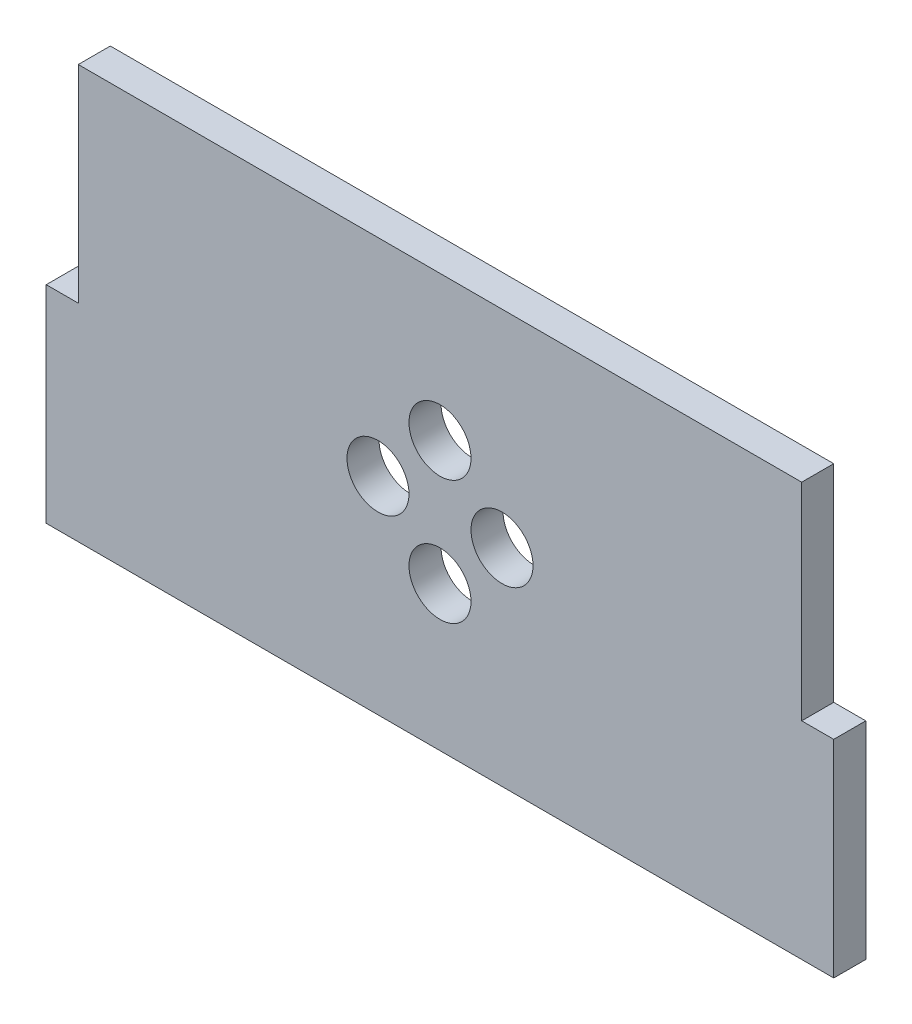
ISO-10303-21;
HEADER;
FILE_DESCRIPTION(('STEP AP214'),'2;1');
FILE_NAME('part.step','',(''),(''),'','','');
FILE_SCHEMA(('AUTOMOTIVE_DESIGN { 1 0 10303 214 1 1 1 1 }'));
ENDSEC;
DATA;
#1=APPLICATION_CONTEXT('core data for automotive mechanical design processes');
#2=APPLICATION_PROTOCOL_DEFINITION('international standard','automotive_design',2000,#1);
#3=PRODUCT_CONTEXT('',#1,'mechanical');
#4=PRODUCT('Part','Part','',(#3));
#5=PRODUCT_RELATED_PRODUCT_CATEGORY('part','',(#4));
#6=PRODUCT_DEFINITION_FORMATION('','',#4);
#7=PRODUCT_DEFINITION_CONTEXT('part definition',#1,'design');
#8=PRODUCT_DEFINITION('design','',#6,#7);
#9=PRODUCT_DEFINITION_SHAPE('','',#8);
#10=(LENGTH_UNIT() NAMED_UNIT(*) SI_UNIT(.MILLI.,.METRE.));
#11=(NAMED_UNIT(*) PLANE_ANGLE_UNIT() SI_UNIT($,.RADIAN.));
#12=(NAMED_UNIT(*) SI_UNIT($,.STERADIAN.) SOLID_ANGLE_UNIT());
#13=UNCERTAINTY_MEASURE_WITH_UNIT(LENGTH_MEASURE(1.E-05),#10,'distance_accuracy_value','');
#14=(GEOMETRIC_REPRESENTATION_CONTEXT(3) GLOBAL_UNCERTAINTY_ASSIGNED_CONTEXT((#13)) GLOBAL_UNIT_ASSIGNED_CONTEXT((#10,
#11,#12)) REPRESENTATION_CONTEXT('',''));
#15=CARTESIAN_POINT('',(0.,0.,0.));
#16=DIRECTION('',(0.,0.,1.));
#17=DIRECTION('',(1.,0.,0.));
#18=AXIS2_PLACEMENT_3D('',#15,#16,#17);
#19=CARTESIAN_POINT('',(35.,-20.,3.1));
#20=DIRECTION('',(-1.,0.,0.));
#21=DIRECTION('',(0.,0.,1.));
#22=AXIS2_PLACEMENT_3D('',#19,#20,#21);
#23=PLANE('',#22);
#24=DIRECTION('',(0.,0.,1.));
#25=VECTOR('',#24,1.);
#26=CARTESIAN_POINT('',(35.,0.,0.));
#27=LINE('',#26,#25);
#28=CARTESIAN_POINT('',(35.,0.,0.));
#29=VERTEX_POINT('',#28);
#30=CARTESIAN_POINT('',(35.,0.,3.1));
#31=VERTEX_POINT('',#30);
#32=EDGE_CURVE('E56',#29,#31,#27,.T.);
#33=ORIENTED_EDGE('',*,*,#32,.F.);
#34=DIRECTION('',(0.,1.,0.));
#35=VECTOR('',#34,1.);
#36=CARTESIAN_POINT('',(35.,-20.,0.));
#37=LINE('',#36,#35);
#38=CARTESIAN_POINT('',(35.,20.,0.));
#39=VERTEX_POINT('',#38);
#40=EDGE_CURVE('E175',#29,#39,#37,.T.);
#41=ORIENTED_EDGE('',*,*,#40,.T.);
#42=DIRECTION('',(0.,0.,-1.));
#43=VECTOR('',#42,1.);
#44=CARTESIAN_POINT('',(35.,20.,3.1));
#45=LINE('',#44,#43);
#46=CARTESIAN_POINT('',(35.,20.,3.1));
#47=VERTEX_POINT('',#46);
#48=EDGE_CURVE('E11',#47,#39,#45,.T.);
#49=ORIENTED_EDGE('',*,*,#48,.F.);
#50=DIRECTION('',(0.,1.,0.));
#51=VECTOR('',#50,1.);
#52=CARTESIAN_POINT('',(35.,-20.,3.1));
#53=LINE('',#52,#51);
#54=EDGE_CURVE('E151',#31,#47,#53,.T.);
#55=ORIENTED_EDGE('',*,*,#54,.F.);
#56=EDGE_LOOP('',(#33,#41,#49,#55));
#57=FACE_BOUND('',#56,.T.);
#58=ADVANCED_FACE('F32',(#57),#23,.F.);
#59=CARTESIAN_POINT('',(0.,0.,3.1));
#60=DIRECTION('',(0.,0.,-1.));
#61=DIRECTION('',(-1.,0.,0.));
#62=AXIS2_PLACEMENT_3D('',#59,#60,#61);
#63=PLANE('',#62);
#64=CARTESIAN_POINT('',(6.,0.,3.1));
#65=DIRECTION('',(0.,0.,1.));
#66=DIRECTION('',(1.,0.,0.));
#67=AXIS2_PLACEMENT_3D('',#64,#65,#66);
#68=CIRCLE('',#67,3.);
#69=CARTESIAN_POINT('',(9.,0.,3.1));
#70=VERTEX_POINT('',#69);
#71=EDGE_CURVE('E193',#70,#70,#68,.T.);
#72=ORIENTED_EDGE('',*,*,#71,.F.);
#73=EDGE_LOOP('',(#72));
#74=FACE_BOUND('',#73,.T.);
#75=CARTESIAN_POINT('',(-6.,0.,3.1));
#76=DIRECTION('',(0.,0.,1.));
#77=DIRECTION('',(1.,0.,0.));
#78=AXIS2_PLACEMENT_3D('',#75,#76,#77);
#79=CIRCLE('',#78,3.);
#80=CARTESIAN_POINT('',(-3.,0.,3.1));
#81=VERTEX_POINT('',#80);
#82=EDGE_CURVE('E176',#81,#81,#79,.T.);
#83=ORIENTED_EDGE('',*,*,#82,.F.);
#84=EDGE_LOOP('',(#83));
#85=FACE_BOUND('',#84,.T.);
#86=DIRECTION('',(1.,0.,0.));
#87=VECTOR('',#86,1.);
#88=CARTESIAN_POINT('',(-35.,-20.,3.1));
#89=LINE('',#88,#87);
#90=CARTESIAN_POINT('',(-38.1,-20.,3.1));
#91=VERTEX_POINT('',#90);
#92=CARTESIAN_POINT('',(38.1,-20.,3.1));
#93=VERTEX_POINT('',#92);
#94=EDGE_CURVE('E174',#91,#93,#89,.T.);
#95=ORIENTED_EDGE('',*,*,#94,.T.);
#96=DIRECTION('',(0.,1.,0.));
#97=VECTOR('',#96,1.);
#98=CARTESIAN_POINT('',(38.1,0.,3.1));
#99=LINE('',#98,#97);
#100=CARTESIAN_POINT('',(38.1,0.,3.1));
#101=VERTEX_POINT('',#100);
#102=EDGE_CURVE('E135',#93,#101,#99,.T.);
#103=ORIENTED_EDGE('',*,*,#102,.T.);
#104=DIRECTION('',(-1.,0.,0.));
#105=VECTOR('',#104,1.);
#106=CARTESIAN_POINT('',(35.,0.,3.1));
#107=LINE('',#106,#105);
#108=EDGE_CURVE('E125',#101,#31,#107,.T.);
#109=ORIENTED_EDGE('',*,*,#108,.T.);
#110=ORIENTED_EDGE('',*,*,#54,.T.);
#111=DIRECTION('',(-1.,0.,0.));
#112=VECTOR('',#111,1.);
#113=CARTESIAN_POINT('',(-35.,20.,3.1));
#114=LINE('',#113,#112);
#115=CARTESIAN_POINT('',(-35.,20.,3.1));
#116=VERTEX_POINT('',#115);
#117=EDGE_CURVE('E181',#47,#116,#114,.T.);
#118=ORIENTED_EDGE('',*,*,#117,.T.);
#119=DIRECTION('',(0.,-1.,0.));
#120=VECTOR('',#119,1.);
#121=CARTESIAN_POINT('',(-35.,-20.,3.1));
#122=LINE('',#121,#120);
#123=CARTESIAN_POINT('',(-35.,0.,3.1));
#124=VERTEX_POINT('',#123);
#125=EDGE_CURVE('E166',#116,#124,#122,.T.);
#126=ORIENTED_EDGE('',*,*,#125,.T.);
#127=DIRECTION('',(-1.,0.,0.));
#128=VECTOR('',#127,1.);
#129=CARTESIAN_POINT('',(-35.,0.,3.1));
#130=LINE('',#129,#128);
#131=CARTESIAN_POINT('',(-38.1,0.,3.1));
#132=VERTEX_POINT('',#131);
#133=EDGE_CURVE('E48',#124,#132,#130,.T.);
#134=ORIENTED_EDGE('',*,*,#133,.T.);
#135=DIRECTION('',(0.,-1.,0.));
#136=VECTOR('',#135,1.);
#137=CARTESIAN_POINT('',(-38.1,0.,3.1));
#138=LINE('',#137,#136);
#139=EDGE_CURVE('E104',#132,#91,#138,.T.);
#140=ORIENTED_EDGE('',*,*,#139,.T.);
#141=EDGE_LOOP('',(#95,#103,#109,#110,#118,#126,#134,#140));
#142=FACE_BOUND('',#141,.T.);
#143=CARTESIAN_POINT('',(0.,5.99999999999998,3.1));
#144=DIRECTION('',(0.,0.,1.));
#145=DIRECTION('',(1.,0.,0.));
#146=AXIS2_PLACEMENT_3D('',#143,#144,#145);
#147=CIRCLE('',#146,3.);
#148=CARTESIAN_POINT('',(3.00000000000002,5.99999999999998,3.1));
#149=VERTEX_POINT('',#148);
#150=EDGE_CURVE('E187',#149,#149,#147,.T.);
#151=ORIENTED_EDGE('',*,*,#150,.F.);
#152=EDGE_LOOP('',(#151));
#153=FACE_BOUND('',#152,.T.);
#154=CARTESIAN_POINT('',(0.,-6.00000000000002,3.1));
#155=DIRECTION('',(0.,0.,1.));
#156=DIRECTION('',(1.,0.,0.));
#157=AXIS2_PLACEMENT_3D('',#154,#155,#156);
#158=CIRCLE('',#157,3.);
#159=CARTESIAN_POINT('',(2.99999999999998,-6.00000000000002,3.1));
#160=VERTEX_POINT('',#159);
#161=EDGE_CURVE('E146',#160,#160,#158,.T.);
#162=ORIENTED_EDGE('',*,*,#161,.F.);
#163=EDGE_LOOP('',(#162));
#164=FACE_BOUND('',#163,.T.);
#165=ADVANCED_FACE('F209',(#74,#85,#142,#153,#164),#63,.F.);
#166=CARTESIAN_POINT('',(0.,0.,0.));
#167=DIRECTION('',(0.,0.,-1.));
#168=DIRECTION('',(-1.,0.,0.));
#169=AXIS2_PLACEMENT_3D('',#166,#167,#168);
#170=PLANE('',#169);
#171=CARTESIAN_POINT('',(6.,0.,0.));
#172=DIRECTION('',(0.,0.,1.));
#173=DIRECTION('',(1.,0.,0.));
#174=AXIS2_PLACEMENT_3D('',#171,#172,#173);
#175=CIRCLE('',#174,3.);
#176=CARTESIAN_POINT('',(9.,0.,0.));
#177=VERTEX_POINT('',#176);
#178=EDGE_CURVE('E196',#177,#177,#175,.T.);
#179=ORIENTED_EDGE('',*,*,#178,.T.);
#180=EDGE_LOOP('',(#179));
#181=FACE_BOUND('',#180,.T.);
#182=CARTESIAN_POINT('',(-6.,0.,0.));
#183=DIRECTION('',(0.,0.,1.));
#184=DIRECTION('',(1.,0.,0.));
#185=AXIS2_PLACEMENT_3D('',#182,#183,#184);
#186=CIRCLE('',#185,3.);
#187=CARTESIAN_POINT('',(-3.,0.,0.));
#188=VERTEX_POINT('',#187);
#189=EDGE_CURVE('E184',#188,#188,#186,.T.);
#190=ORIENTED_EDGE('',*,*,#189,.T.);
#191=EDGE_LOOP('',(#190));
#192=FACE_BOUND('',#191,.T.);
#193=ORIENTED_EDGE('',*,*,#40,.F.);
#194=DIRECTION('',(-1.,0.,0.));
#195=VECTOR('',#194,1.);
#196=CARTESIAN_POINT('',(35.,0.,0.));
#197=LINE('',#196,#195);
#198=CARTESIAN_POINT('',(38.1,0.,0.));
#199=VERTEX_POINT('',#198);
#200=EDGE_CURVE('E134',#199,#29,#197,.T.);
#201=ORIENTED_EDGE('',*,*,#200,.F.);
#202=DIRECTION('',(0.,1.,0.));
#203=VECTOR('',#202,1.);
#204=CARTESIAN_POINT('',(38.1,0.,0.));
#205=LINE('',#204,#203);
#206=CARTESIAN_POINT('',(38.1,-20.,0.));
#207=VERTEX_POINT('',#206);
#208=EDGE_CURVE('E131',#207,#199,#205,.T.);
#209=ORIENTED_EDGE('',*,*,#208,.F.);
#210=DIRECTION('',(1.,0.,0.));
#211=VECTOR('',#210,1.);
#212=CARTESIAN_POINT('',(-35.,-20.,0.));
#213=LINE('',#212,#211);
#214=CARTESIAN_POINT('',(-38.1,-20.,0.));
#215=VERTEX_POINT('',#214);
#216=EDGE_CURVE('E116',#215,#207,#213,.T.);
#217=ORIENTED_EDGE('',*,*,#216,.F.);
#218=DIRECTION('',(0.,-1.,0.));
#219=VECTOR('',#218,1.);
#220=CARTESIAN_POINT('',(-38.1,0.,0.));
#221=LINE('',#220,#219);
#222=CARTESIAN_POINT('',(-38.1,0.,0.));
#223=VERTEX_POINT('',#222);
#224=EDGE_CURVE('E102',#223,#215,#221,.T.);
#225=ORIENTED_EDGE('',*,*,#224,.F.);
#226=DIRECTION('',(-1.,0.,0.));
#227=VECTOR('',#226,1.);
#228=CARTESIAN_POINT('',(-35.,0.,0.));
#229=LINE('',#228,#227);
#230=CARTESIAN_POINT('',(-35.,0.,0.));
#231=VERTEX_POINT('',#230);
#232=EDGE_CURVE('E113',#231,#223,#229,.T.);
#233=ORIENTED_EDGE('',*,*,#232,.F.);
#234=DIRECTION('',(0.,-1.,0.));
#235=VECTOR('',#234,1.);
#236=CARTESIAN_POINT('',(-35.,-20.,0.));
#237=LINE('',#236,#235);
#238=CARTESIAN_POINT('',(-35.,20.,0.));
#239=VERTEX_POINT('',#238);
#240=EDGE_CURVE('E162',#239,#231,#237,.T.);
#241=ORIENTED_EDGE('',*,*,#240,.F.);
#242=DIRECTION('',(-1.,0.,0.));
#243=VECTOR('',#242,1.);
#244=CARTESIAN_POINT('',(-35.,20.,0.));
#245=LINE('',#244,#243);
#246=EDGE_CURVE('E165',#39,#239,#245,.T.);
#247=ORIENTED_EDGE('',*,*,#246,.F.);
#248=EDGE_LOOP('',(#193,#201,#209,#217,#225,#233,#241,#247));
#249=FACE_BOUND('',#248,.T.);
#250=CARTESIAN_POINT('',(0.,5.99999999999998,0.));
#251=DIRECTION('',(0.,0.,1.));
#252=DIRECTION('',(1.,0.,0.));
#253=AXIS2_PLACEMENT_3D('',#250,#251,#252);
#254=CIRCLE('',#253,3.);
#255=CARTESIAN_POINT('',(3.00000000000002,5.99999999999998,0.));
#256=VERTEX_POINT('',#255);
#257=EDGE_CURVE('E190',#256,#256,#254,.T.);
#258=ORIENTED_EDGE('',*,*,#257,.T.);
#259=EDGE_LOOP('',(#258));
#260=FACE_BOUND('',#259,.T.);
#261=CARTESIAN_POINT('',(0.,-6.00000000000002,0.));
#262=DIRECTION('',(0.,0.,1.));
#263=DIRECTION('',(1.,0.,0.));
#264=AXIS2_PLACEMENT_3D('',#261,#262,#263);
#265=CIRCLE('',#264,3.);
#266=CARTESIAN_POINT('',(2.99999999999998,-6.00000000000002,0.));
#267=VERTEX_POINT('',#266);
#268=EDGE_CURVE('E140',#267,#267,#265,.T.);
#269=ORIENTED_EDGE('',*,*,#268,.T.);
#270=EDGE_LOOP('',(#269));
#271=FACE_BOUND('',#270,.T.);
#272=ADVANCED_FACE('F110',(#181,#192,#249,#260,#271),#170,.T.);
#273=CARTESIAN_POINT('',(-35.,20.,3.1));
#274=DIRECTION('',(0.,-1.,0.));
#275=DIRECTION('',(0.,0.,-1.));
#276=AXIS2_PLACEMENT_3D('',#273,#274,#275);
#277=PLANE('',#276);
#278=ORIENTED_EDGE('',*,*,#246,.T.);
#279=DIRECTION('',(0.,0.,-1.));
#280=VECTOR('',#279,1.);
#281=CARTESIAN_POINT('',(-35.,20.,3.1));
#282=LINE('',#281,#280);
#283=EDGE_CURVE('E40',#116,#239,#282,.T.);
#284=ORIENTED_EDGE('',*,*,#283,.F.);
#285=ORIENTED_EDGE('',*,*,#117,.F.);
#286=ORIENTED_EDGE('',*,*,#48,.T.);
#287=EDGE_LOOP('',(#278,#284,#285,#286));
#288=FACE_BOUND('',#287,.T.);
#289=ADVANCED_FACE('F217',(#288),#277,.F.);
#290=CARTESIAN_POINT('',(-35.,-20.,3.1));
#291=DIRECTION('',(1.,0.,0.));
#292=DIRECTION('',(0.,0.,-1.));
#293=AXIS2_PLACEMENT_3D('',#290,#291,#292);
#294=PLANE('',#293);
#295=ORIENTED_EDGE('',*,*,#240,.T.);
#296=DIRECTION('',(0.,0.,1.));
#297=VECTOR('',#296,1.);
#298=CARTESIAN_POINT('',(-35.,0.,0.));
#299=LINE('',#298,#297);
#300=EDGE_CURVE('E120',#231,#124,#299,.T.);
#301=ORIENTED_EDGE('',*,*,#300,.T.);
#302=ORIENTED_EDGE('',*,*,#125,.F.);
#303=ORIENTED_EDGE('',*,*,#283,.T.);
#304=EDGE_LOOP('',(#295,#301,#302,#303));
#305=FACE_BOUND('',#304,.T.);
#306=ADVANCED_FACE('F229',(#305),#294,.F.);
#307=CARTESIAN_POINT('',(-35.,-20.,3.1));
#308=DIRECTION('',(0.,1.,0.));
#309=DIRECTION('',(0.,0.,1.));
#310=AXIS2_PLACEMENT_3D('',#307,#308,#309);
#311=PLANE('',#310);
#312=ORIENTED_EDGE('',*,*,#216,.T.);
#313=DIRECTION('',(0.,0.,1.));
#314=VECTOR('',#313,1.);
#315=CARTESIAN_POINT('',(38.1,-20.,0.));
#316=LINE('',#315,#314);
#317=EDGE_CURVE('E141',#207,#93,#316,.T.);
#318=ORIENTED_EDGE('',*,*,#317,.T.);
#319=ORIENTED_EDGE('',*,*,#94,.F.);
#320=DIRECTION('',(0.,0.,1.));
#321=VECTOR('',#320,1.);
#322=CARTESIAN_POINT('',(-38.1,-20.,0.));
#323=LINE('',#322,#321);
#324=EDGE_CURVE('E106',#215,#91,#323,.T.);
#325=ORIENTED_EDGE('',*,*,#324,.F.);
#326=EDGE_LOOP('',(#312,#318,#319,#325));
#327=FACE_BOUND('',#326,.T.);
#328=ADVANCED_FACE('F226',(#327),#311,.F.);
#329=CARTESIAN_POINT('',(-6.,0.,3.1));
#330=DIRECTION('',(0.,0.,-1.));
#331=DIRECTION('',(-1.,0.,0.));
#332=AXIS2_PLACEMENT_3D('',#329,#330,#331);
#333=CYLINDRICAL_SURFACE('',#332,3.);
#334=ORIENTED_EDGE('',*,*,#82,.T.);
#335=EDGE_LOOP('',(#334));
#336=FACE_BOUND('',#335,.T.);
#337=ORIENTED_EDGE('',*,*,#189,.F.);
#338=EDGE_LOOP('',(#337));
#339=FACE_BOUND('',#338,.T.);
#340=ADVANCED_FACE('F223',(#336,#339),#333,.F.);
#341=CARTESIAN_POINT('',(0.,5.99999999999998,3.1));
#342=DIRECTION('',(0.,0.,-1.));
#343=DIRECTION('',(-1.,0.,0.));
#344=AXIS2_PLACEMENT_3D('',#341,#342,#343);
#345=CYLINDRICAL_SURFACE('',#344,3.);
#346=ORIENTED_EDGE('',*,*,#150,.T.);
#347=EDGE_LOOP('',(#346));
#348=FACE_BOUND('',#347,.T.);
#349=ORIENTED_EDGE('',*,*,#257,.F.);
#350=EDGE_LOOP('',(#349));
#351=FACE_BOUND('',#350,.T.);
#352=ADVANCED_FACE('F267',(#348,#351),#345,.F.);
#353=CARTESIAN_POINT('',(6.,0.,3.1));
#354=DIRECTION('',(0.,0.,-1.));
#355=DIRECTION('',(-1.,0.,0.));
#356=AXIS2_PLACEMENT_3D('',#353,#354,#355);
#357=CYLINDRICAL_SURFACE('',#356,3.);
#358=ORIENTED_EDGE('',*,*,#71,.T.);
#359=EDGE_LOOP('',(#358));
#360=FACE_BOUND('',#359,.T.);
#361=ORIENTED_EDGE('',*,*,#178,.F.);
#362=EDGE_LOOP('',(#361));
#363=FACE_BOUND('',#362,.T.);
#364=ADVANCED_FACE('F265',(#360,#363),#357,.F.);
#365=CARTESIAN_POINT('',(0.,-6.00000000000002,3.1));
#366=DIRECTION('',(0.,0.,-1.));
#367=DIRECTION('',(-1.,0.,0.));
#368=AXIS2_PLACEMENT_3D('',#365,#366,#367);
#369=CYLINDRICAL_SURFACE('',#368,3.);
#370=ORIENTED_EDGE('',*,*,#161,.T.);
#371=EDGE_LOOP('',(#370));
#372=FACE_BOUND('',#371,.T.);
#373=ORIENTED_EDGE('',*,*,#268,.F.);
#374=EDGE_LOOP('',(#373));
#375=FACE_BOUND('',#374,.T.);
#376=ADVANCED_FACE('F206',(#372,#375),#369,.F.);
#377=CARTESIAN_POINT('',(35.,0.,0.));
#378=DIRECTION('',(0.,1.,0.));
#379=DIRECTION('',(-1.,0.,0.));
#380=AXIS2_PLACEMENT_3D('',#377,#378,#379);
#381=PLANE('',#380);
#382=ORIENTED_EDGE('',*,*,#108,.F.);
#383=DIRECTION('',(0.,0.,1.));
#384=VECTOR('',#383,1.);
#385=CARTESIAN_POINT('',(38.1,0.,0.));
#386=LINE('',#385,#384);
#387=EDGE_CURVE('E138',#199,#101,#386,.T.);
#388=ORIENTED_EDGE('',*,*,#387,.F.);
#389=ORIENTED_EDGE('',*,*,#200,.T.);
#390=ORIENTED_EDGE('',*,*,#32,.T.);
#391=EDGE_LOOP('',(#382,#388,#389,#390));
#392=FACE_BOUND('',#391,.T.);
#393=ADVANCED_FACE('F248',(#392),#381,.T.);
#394=CARTESIAN_POINT('',(38.1,0.,0.));
#395=DIRECTION('',(1.,0.,0.));
#396=DIRECTION('',(0.,1.,0.));
#397=AXIS2_PLACEMENT_3D('',#394,#395,#396);
#398=PLANE('',#397);
#399=ORIENTED_EDGE('',*,*,#102,.F.);
#400=ORIENTED_EDGE('',*,*,#317,.F.);
#401=ORIENTED_EDGE('',*,*,#208,.T.);
#402=ORIENTED_EDGE('',*,*,#387,.T.);
#403=EDGE_LOOP('',(#399,#400,#401,#402));
#404=FACE_BOUND('',#403,.T.);
#405=ADVANCED_FACE('F251',(#404),#398,.T.);
#406=CARTESIAN_POINT('',(-35.,0.,0.));
#407=DIRECTION('',(0.,1.,0.));
#408=DIRECTION('',(-1.,0.,0.));
#409=AXIS2_PLACEMENT_3D('',#406,#407,#408);
#410=PLANE('',#409);
#411=ORIENTED_EDGE('',*,*,#133,.F.);
#412=ORIENTED_EDGE('',*,*,#300,.F.);
#413=ORIENTED_EDGE('',*,*,#232,.T.);
#414=DIRECTION('',(0.,0.,1.));
#415=VECTOR('',#414,1.);
#416=CARTESIAN_POINT('',(-38.1,0.,0.));
#417=LINE('',#416,#415);
#418=EDGE_CURVE('E98',#223,#132,#417,.T.);
#419=ORIENTED_EDGE('',*,*,#418,.T.);
#420=EDGE_LOOP('',(#411,#412,#413,#419));
#421=FACE_BOUND('',#420,.T.);
#422=ADVANCED_FACE('F119',(#421),#410,.T.);
#423=CARTESIAN_POINT('',(-38.1,0.,0.));
#424=DIRECTION('',(-1.,0.,0.));
#425=DIRECTION('',(0.,-1.,0.));
#426=AXIS2_PLACEMENT_3D('',#423,#424,#425);
#427=PLANE('',#426);
#428=ORIENTED_EDGE('',*,*,#139,.F.);
#429=ORIENTED_EDGE('',*,*,#418,.F.);
#430=ORIENTED_EDGE('',*,*,#224,.T.);
#431=ORIENTED_EDGE('',*,*,#324,.T.);
#432=EDGE_LOOP('',(#428,#429,#430,#431));
#433=FACE_BOUND('',#432,.T.);
#434=ADVANCED_FACE('F100',(#433),#427,.T.);
#435=CLOSED_SHELL('',(#58,#165,#272,#289,#306,#328,#340,#352,#364,#376,#393,#405,#422,#434));
#436=MANIFOLD_SOLID_BREP('B2',#435);
#437=ADVANCED_BREP_SHAPE_REPRESENTATION('',(#18,#436),#14);
#438=SHAPE_DEFINITION_REPRESENTATION(#9,#437);
ENDSEC;
END-ISO-10303-21;
